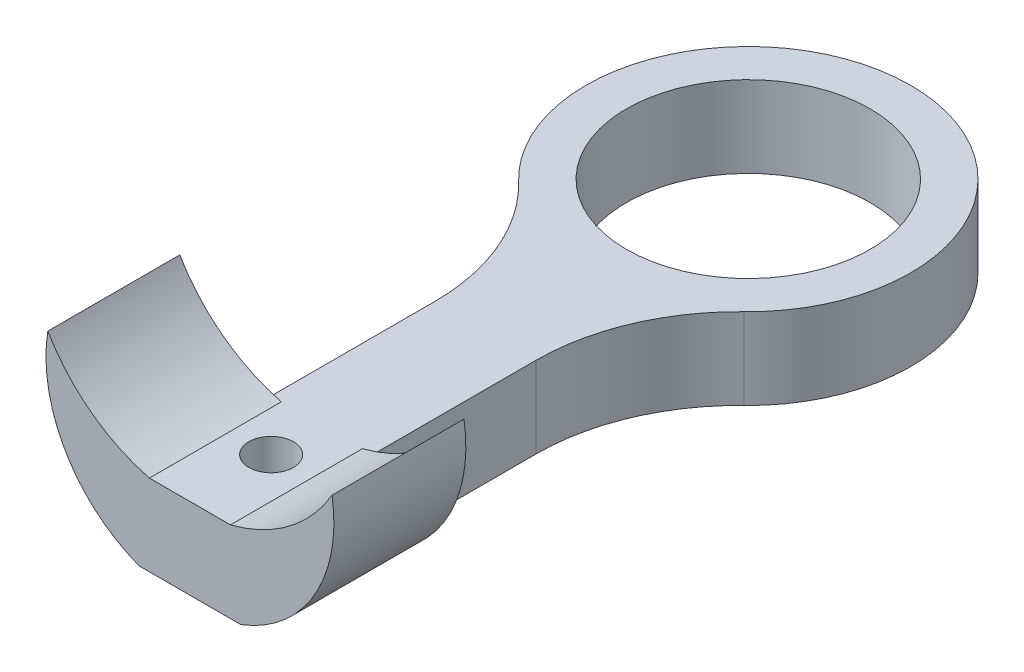
ISO-10303-21;
HEADER;
FILE_DESCRIPTION(('STEP AP214'),'2;1');
FILE_NAME('part.step','',(''),(''),'','','');
FILE_SCHEMA(('AUTOMOTIVE_DESIGN { 1 0 10303 214 1 1 1 1 }'));
ENDSEC;
DATA;
#1=APPLICATION_CONTEXT('core data for automotive mechanical design processes');
#2=APPLICATION_PROTOCOL_DEFINITION('international standard','automotive_design',2000,#1);
#3=PRODUCT_CONTEXT('',#1,'mechanical');
#4=PRODUCT('Part','Part','',(#3));
#5=PRODUCT_RELATED_PRODUCT_CATEGORY('part','',(#4));
#6=PRODUCT_DEFINITION_FORMATION('','',#4);
#7=PRODUCT_DEFINITION_CONTEXT('part definition',#1,'design');
#8=PRODUCT_DEFINITION('design','',#6,#7);
#9=PRODUCT_DEFINITION_SHAPE('','',#8);
#10=(LENGTH_UNIT() NAMED_UNIT(*) SI_UNIT(.MILLI.,.METRE.));
#11=(NAMED_UNIT(*) PLANE_ANGLE_UNIT() SI_UNIT($,.RADIAN.));
#12=(NAMED_UNIT(*) SI_UNIT($,.STERADIAN.) SOLID_ANGLE_UNIT());
#13=UNCERTAINTY_MEASURE_WITH_UNIT(LENGTH_MEASURE(1.E-05),#10,'distance_accuracy_value','');
#14=(GEOMETRIC_REPRESENTATION_CONTEXT(3) GLOBAL_UNCERTAINTY_ASSIGNED_CONTEXT((#13)) GLOBAL_UNIT_ASSIGNED_CONTEXT((#10,
#11,#12)) REPRESENTATION_CONTEXT('',''));
#15=CARTESIAN_POINT('',(0.,0.,0.));
#16=DIRECTION('',(0.,0.,1.));
#17=DIRECTION('',(1.,0.,0.));
#18=AXIS2_PLACEMENT_3D('',#15,#16,#17);
#19=CARTESIAN_POINT('',(12.5,4.,12.9518338469886));
#20=DIRECTION('',(0.,1.,0.));
#21=DIRECTION('',(0.,0.,1.));
#22=AXIS2_PLACEMENT_3D('',#19,#20,#21);
#23=PLANE('',#22);
#24=CARTESIAN_POINT('',(0.,4.,0.));
#25=DIRECTION('',(0.,1.,0.));
#26=DIRECTION('',(0.,0.,1.));
#27=AXIS2_PLACEMENT_3D('',#24,#25,#26);
#28=CIRCLE('',#27,6.);
#29=CARTESIAN_POINT('',(0.,4.,6.));
#30=VERTEX_POINT('',#29);
#31=EDGE_CURVE('E169',#30,#30,#28,.T.);
#32=ORIENTED_EDGE('',*,*,#31,.F.);
#33=EDGE_LOOP('',(#32));
#34=FACE_BOUND('',#33,.T.);
#35=CARTESIAN_POINT('',(0.,4.,23.5));
#36=DIRECTION('',(0.,1.,0.));
#37=DIRECTION('',(0.,0.,1.));
#38=AXIS2_PLACEMENT_3D('',#35,#36,#37);
#39=CIRCLE('',#38,1.1);
#40=CARTESIAN_POINT('',(0.,4.,24.6));
#41=VERTEX_POINT('',#40);
#42=EDGE_CURVE('E163',#41,#41,#39,.T.);
#43=ORIENTED_EDGE('',*,*,#42,.F.);
#44=EDGE_LOOP('',(#43));
#45=FACE_BOUND('',#44,.T.);
#46=DIRECTION('',(1.,0.,0.));
#47=VECTOR('',#46,1.);
#48=CARTESIAN_POINT('',(-2.5,4.,27.5));
#49=LINE('',#48,#47);
#50=CARTESIAN_POINT('',(-1.99783536705259,4.,27.5));
#51=VERTEX_POINT('',#50);
#52=CARTESIAN_POINT('',(1.9978353670526,4.,27.5));
#53=VERTEX_POINT('',#52);
#54=EDGE_CURVE('E135',#51,#53,#49,.T.);
#55=ORIENTED_EDGE('',*,*,#54,.T.);
#56=DIRECTION('',(0.,0.,1.));
#57=VECTOR('',#56,1.);
#58=CARTESIAN_POINT('',(1.9978353670526,4.,11.7121984810812));
#59=LINE('',#58,#57);
#60=CARTESIAN_POINT('',(1.9978353670526,4.,21.0000000000125));
#61=VERTEX_POINT('',#60);
#62=EDGE_CURVE('E128',#61,#53,#59,.T.);
#63=ORIENTED_EDGE('',*,*,#62,.F.);
#64=DIRECTION('',(-1.,0.,0.));
#65=VECTOR('',#64,1.);
#66=CARTESIAN_POINT('',(12.5,4.,21.0000000000125));
#67=LINE('',#66,#65);
#68=CARTESIAN_POINT('',(2.5,4.,21.0000000000125));
#69=VERTEX_POINT('',#68);
#70=EDGE_CURVE('E117',#69,#61,#67,.T.);
#71=ORIENTED_EDGE('',*,*,#70,.F.);
#72=DIRECTION('',(0.,0.,-1.));
#73=VECTOR('',#72,1.);
#74=CARTESIAN_POINT('',(2.5,4.,12.9518338469886));
#75=LINE('',#74,#73);
#76=CARTESIAN_POINT('',(2.5,4.,12.9518338469886));
#77=VERTEX_POINT('',#76);
#78=EDGE_CURVE('E179',#69,#77,#75,.T.);
#79=ORIENTED_EDGE('',*,*,#78,.T.);
#80=CARTESIAN_POINT('',(12.5,4.,12.9518338469886));
#81=DIRECTION('',(0.,-1.,0.));
#82=DIRECTION('',(0.,0.,1.));
#83=AXIS2_PLACEMENT_3D('',#80,#81,#82);
#84=CIRCLE('',#83,10.);
#85=CARTESIAN_POINT('',(5.55555555555555,4.,5.75637059866161));
#86=VERTEX_POINT('',#85);
#87=EDGE_CURVE('E181',#77,#86,#84,.T.);
#88=ORIENTED_EDGE('',*,*,#87,.T.);
#89=CARTESIAN_POINT('',(0.,4.,0.));
#90=DIRECTION('',(0.,1.,0.));
#91=DIRECTION('',(0.,0.,1.));
#92=AXIS2_PLACEMENT_3D('',#89,#90,#91);
#93=CIRCLE('',#92,8.);
#94=CARTESIAN_POINT('',(-5.55555555555555,4.,5.75637059866161));
#95=VERTEX_POINT('',#94);
#96=EDGE_CURVE('E183',#86,#95,#93,.T.);
#97=ORIENTED_EDGE('',*,*,#96,.T.);
#98=CARTESIAN_POINT('',(-12.5,4.,12.9518338469886));
#99=DIRECTION('',(0.,-1.,0.));
#100=DIRECTION('',(0.,0.,-1.));
#101=AXIS2_PLACEMENT_3D('',#98,#99,#100);
#102=CIRCLE('',#101,10.);
#103=CARTESIAN_POINT('',(-2.5,4.,12.9518338469886));
#104=VERTEX_POINT('',#103);
#105=EDGE_CURVE('E185',#95,#104,#102,.T.);
#106=ORIENTED_EDGE('',*,*,#105,.T.);
#107=DIRECTION('',(0.,0.,1.));
#108=VECTOR('',#107,1.);
#109=CARTESIAN_POINT('',(-2.5,4.,12.9518338469886));
#110=LINE('',#109,#108);
#111=CARTESIAN_POINT('',(-2.5,4.,21.0000000000125));
#112=VERTEX_POINT('',#111);
#113=EDGE_CURVE('E175',#104,#112,#110,.T.);
#114=ORIENTED_EDGE('',*,*,#113,.T.);
#115=DIRECTION('',(-1.,0.,0.));
#116=VECTOR('',#115,1.);
#117=CARTESIAN_POINT('',(12.5,4.,21.0000000000125));
#118=LINE('',#117,#116);
#119=CARTESIAN_POINT('',(-1.99783536705259,4.,21.0000000000125));
#120=VERTEX_POINT('',#119);
#121=EDGE_CURVE('E57',#120,#112,#118,.T.);
#122=ORIENTED_EDGE('',*,*,#121,.F.);
#123=DIRECTION('',(0.,0.,1.));
#124=VECTOR('',#123,1.);
#125=CARTESIAN_POINT('',(-1.9978353670526,4.,11.7121984810812));
#126=LINE('',#125,#124);
#127=EDGE_CURVE('E146',#120,#51,#126,.T.);
#128=ORIENTED_EDGE('',*,*,#127,.T.);
#129=EDGE_LOOP('',(#55,#63,#71,#79,#88,#97,#106,#114,#122,#128));
#130=FACE_BOUND('',#129,.T.);
#131=ADVANCED_FACE('F34',(#34,#45,#130),#23,.T.);
#132=CARTESIAN_POINT('',(12.5,0.,12.9518338469886));
#133=DIRECTION('',(0.,1.,0.));
#134=DIRECTION('',(0.,0.,1.));
#135=AXIS2_PLACEMENT_3D('',#132,#133,#134);
#136=PLANE('',#135);
#137=DIRECTION('',(0.,0.,1.));
#138=VECTOR('',#137,1.);
#139=CARTESIAN_POINT('',(-2.5,0.,12.9518338469886));
#140=LINE('',#139,#138);
#141=CARTESIAN_POINT('',(-2.5,0.,12.9518338469886));
#142=VERTEX_POINT('',#141);
#143=CARTESIAN_POINT('',(-2.5,0.,21.0000000000125));
#144=VERTEX_POINT('',#143);
#145=EDGE_CURVE('E172',#142,#144,#140,.T.);
#146=ORIENTED_EDGE('',*,*,#145,.F.);
#147=CARTESIAN_POINT('',(-12.5,0.,12.9518338469886));
#148=DIRECTION('',(0.,-1.,0.));
#149=DIRECTION('',(0.,0.,-1.));
#150=AXIS2_PLACEMENT_3D('',#147,#148,#149);
#151=CIRCLE('',#150,10.);
#152=CARTESIAN_POINT('',(-5.55555555555555,0.,5.75637059866161));
#153=VERTEX_POINT('',#152);
#154=EDGE_CURVE('E177',#153,#142,#151,.T.);
#155=ORIENTED_EDGE('',*,*,#154,.F.);
#156=CARTESIAN_POINT('',(0.,0.,0.));
#157=DIRECTION('',(0.,1.,0.));
#158=DIRECTION('',(0.,0.,1.));
#159=AXIS2_PLACEMENT_3D('',#156,#157,#158);
#160=CIRCLE('',#159,8.);
#161=CARTESIAN_POINT('',(5.55555555555555,0.,5.75637059866161));
#162=VERTEX_POINT('',#161);
#163=EDGE_CURVE('E198',#162,#153,#160,.T.);
#164=ORIENTED_EDGE('',*,*,#163,.F.);
#165=CARTESIAN_POINT('',(12.5,0.,12.9518338469886));
#166=DIRECTION('',(0.,-1.,0.));
#167=DIRECTION('',(0.,0.,1.));
#168=AXIS2_PLACEMENT_3D('',#165,#166,#167);
#169=CIRCLE('',#168,10.);
#170=CARTESIAN_POINT('',(2.5,0.,12.9518338469886));
#171=VERTEX_POINT('',#170);
#172=EDGE_CURVE('E196',#171,#162,#169,.T.);
#173=ORIENTED_EDGE('',*,*,#172,.F.);
#174=DIRECTION('',(0.,0.,-1.));
#175=VECTOR('',#174,1.);
#176=CARTESIAN_POINT('',(2.5,0.,12.9518338469886));
#177=LINE('',#176,#175);
#178=CARTESIAN_POINT('',(2.5,0.,21.0000000000125));
#179=VERTEX_POINT('',#178);
#180=EDGE_CURVE('E193',#179,#171,#177,.T.);
#181=ORIENTED_EDGE('',*,*,#180,.F.);
#182=CARTESIAN_POINT('',(2.5,0.,27.5));
#183=VERTEX_POINT('',#182);
#184=EDGE_CURVE('E194',#183,#179,#177,.T.);
#185=ORIENTED_EDGE('',*,*,#184,.F.);
#186=DIRECTION('',(1.,0.,0.));
#187=VECTOR('',#186,1.);
#188=CARTESIAN_POINT('',(-2.5,0.,27.5));
#189=LINE('',#188,#187);
#190=CARTESIAN_POINT('',(-2.5,0.,27.5));
#191=VERTEX_POINT('',#190);
#192=EDGE_CURVE('E190',#191,#183,#189,.T.);
#193=ORIENTED_EDGE('',*,*,#192,.F.);
#194=DIRECTION('',(0.,0.,1.));
#195=VECTOR('',#194,1.);
#196=CARTESIAN_POINT('',(-2.5,0.,11.7121984810812));
#197=LINE('',#196,#195);
#198=EDGE_CURVE('E152',#144,#191,#197,.T.);
#199=ORIENTED_EDGE('',*,*,#198,.F.);
#200=EDGE_LOOP('',(#146,#155,#164,#173,#181,#185,#193,#199));
#201=FACE_BOUND('',#200,.T.);
#202=CARTESIAN_POINT('',(0.,0.,0.));
#203=DIRECTION('',(0.,1.,0.));
#204=DIRECTION('',(0.,0.,1.));
#205=AXIS2_PLACEMENT_3D('',#202,#203,#204);
#206=CIRCLE('',#205,6.);
#207=CARTESIAN_POINT('',(0.,0.,6.));
#208=VERTEX_POINT('',#207);
#209=EDGE_CURVE('E166',#208,#208,#206,.T.);
#210=ORIENTED_EDGE('',*,*,#209,.T.);
#211=EDGE_LOOP('',(#210));
#212=FACE_BOUND('',#211,.T.);
#213=CARTESIAN_POINT('',(0.,0.,23.5));
#214=DIRECTION('',(0.,1.,0.));
#215=DIRECTION('',(0.,0.,1.));
#216=AXIS2_PLACEMENT_3D('',#213,#214,#215);
#217=CIRCLE('',#216,1.1);
#218=CARTESIAN_POINT('',(0.,0.,24.6));
#219=VERTEX_POINT('',#218);
#220=EDGE_CURVE('E162',#219,#219,#217,.T.);
#221=ORIENTED_EDGE('',*,*,#220,.T.);
#222=EDGE_LOOP('',(#221));
#223=FACE_BOUND('',#222,.T.);
#224=ADVANCED_FACE('F236',(#201,#212,#223),#136,.F.);
#225=CARTESIAN_POINT('',(-2.5,4.,12.9518338469886));
#226=DIRECTION('',(1.,0.,0.));
#227=DIRECTION('',(0.,0.,-1.));
#228=AXIS2_PLACEMENT_3D('',#225,#226,#227);
#229=PLANE('',#228);
#230=ORIENTED_EDGE('',*,*,#145,.T.);
#231=DIRECTION('',(0.,1.,0.));
#232=VECTOR('',#231,1.);
#233=CARTESIAN_POINT('',(-2.5,4.,21.0000000000125));
#234=LINE('',#233,#232);
#235=EDGE_CURVE('E42',#144,#112,#234,.T.);
#236=ORIENTED_EDGE('',*,*,#235,.T.);
#237=ORIENTED_EDGE('',*,*,#113,.F.);
#238=DIRECTION('',(0.,-1.,0.));
#239=VECTOR('',#238,1.);
#240=CARTESIAN_POINT('',(-2.5,4.,12.9518338469886));
#241=LINE('',#240,#239);
#242=EDGE_CURVE('E187',#104,#142,#241,.T.);
#243=ORIENTED_EDGE('',*,*,#242,.T.);
#244=EDGE_LOOP('',(#230,#236,#237,#243));
#245=FACE_BOUND('',#244,.T.);
#246=ADVANCED_FACE('F36',(#245),#229,.F.);
#247=CARTESIAN_POINT('',(-2.5,4.,27.5));
#248=DIRECTION('',(0.,0.,-1.));
#249=DIRECTION('',(-1.,0.,0.));
#250=AXIS2_PLACEMENT_3D('',#247,#248,#249);
#251=PLANE('',#250);
#252=CARTESIAN_POINT('',(0.,11.8576923076923,27.5));
#253=DIRECTION('',(0.,0.,1.));
#254=DIRECTION('',(-1.,0.,0.));
#255=AXIS2_PLACEMENT_3D('',#252,#253,#254);
#256=CIRCLE('',#255,8.10769230769231);
#257=CARTESIAN_POINT('',(7.,7.7668886511704,27.5));
#258=VERTEX_POINT('',#257);
#259=EDGE_CURVE('E131',#53,#258,#256,.T.);
#260=ORIENTED_EDGE('',*,*,#259,.F.);
#261=ORIENTED_EDGE('',*,*,#54,.F.);
#262=CARTESIAN_POINT('',(0.,11.8576923076923,27.5));
#263=DIRECTION('',(0.,0.,-1.));
#264=DIRECTION('',(1.,0.,0.));
#265=AXIS2_PLACEMENT_3D('',#262,#263,#264);
#266=CIRCLE('',#265,8.10769230769231);
#267=CARTESIAN_POINT('',(-7.,7.7668886511704,27.5));
#268=VERTEX_POINT('',#267);
#269=EDGE_CURVE('E143',#51,#268,#266,.T.);
#270=ORIENTED_EDGE('',*,*,#269,.T.);
#271=CARTESIAN_POINT('',(0.,6.63551158958273,27.5));
#272=DIRECTION('',(0.,0.,1.));
#273=DIRECTION('',(1.,0.,0.));
#274=AXIS2_PLACEMENT_3D('',#271,#272,#273);
#275=CIRCLE('',#274,7.09084015159606);
#276=EDGE_CURVE('E123',#268,#191,#275,.T.);
#277=ORIENTED_EDGE('',*,*,#276,.T.);
#278=ORIENTED_EDGE('',*,*,#192,.T.);
#279=CARTESIAN_POINT('',(0.,6.63551158958273,27.5));
#280=DIRECTION('',(0.,0.,-1.));
#281=DIRECTION('',(-1.,0.,0.));
#282=AXIS2_PLACEMENT_3D('',#279,#280,#281);
#283=CIRCLE('',#282,7.09084015159606);
#284=EDGE_CURVE('E136',#258,#183,#283,.T.);
#285=ORIENTED_EDGE('',*,*,#284,.F.);
#286=EDGE_LOOP('',(#260,#261,#270,#277,#278,#285));
#287=FACE_BOUND('',#286,.T.);
#288=ADVANCED_FACE('F225',(#287),#251,.F.);
#289=CARTESIAN_POINT('',(2.5,4.,12.9518338469886));
#290=DIRECTION('',(-1.,0.,0.));
#291=DIRECTION('',(0.,0.,1.));
#292=AXIS2_PLACEMENT_3D('',#289,#290,#291);
#293=PLANE('',#292);
#294=ORIENTED_EDGE('',*,*,#78,.F.);
#295=DIRECTION('',(0.,-1.,0.));
#296=VECTOR('',#295,1.);
#297=CARTESIAN_POINT('',(2.5,4.,21.0000000000125));
#298=LINE('',#297,#296);
#299=EDGE_CURVE('E11',#69,#179,#298,.T.);
#300=ORIENTED_EDGE('',*,*,#299,.T.);
#301=ORIENTED_EDGE('',*,*,#180,.T.);
#302=DIRECTION('',(0.,-1.,0.));
#303=VECTOR('',#302,1.);
#304=CARTESIAN_POINT('',(2.5,4.,12.9518338469886));
#305=LINE('',#304,#303);
#306=EDGE_CURVE('E209',#77,#171,#305,.T.);
#307=ORIENTED_EDGE('',*,*,#306,.F.);
#308=EDGE_LOOP('',(#294,#300,#301,#307));
#309=FACE_BOUND('',#308,.T.);
#310=ADVANCED_FACE('F233',(#309),#293,.F.);
#311=CARTESIAN_POINT('',(12.5,4.,12.9518338469886));
#312=DIRECTION('',(0.,-1.,0.));
#313=DIRECTION('',(0.,0.,-1.));
#314=AXIS2_PLACEMENT_3D('',#311,#312,#313);
#315=CYLINDRICAL_SURFACE('',#314,10.);
#316=ORIENTED_EDGE('',*,*,#172,.T.);
#317=DIRECTION('',(0.,-1.,0.));
#318=VECTOR('',#317,1.);
#319=CARTESIAN_POINT('',(5.55555555555555,4.,5.75637059866161));
#320=LINE('',#319,#318);
#321=EDGE_CURVE('E206',#86,#162,#320,.T.);
#322=ORIENTED_EDGE('',*,*,#321,.F.);
#323=ORIENTED_EDGE('',*,*,#87,.F.);
#324=ORIENTED_EDGE('',*,*,#306,.T.);
#325=EDGE_LOOP('',(#316,#322,#323,#324));
#326=FACE_BOUND('',#325,.T.);
#327=ADVANCED_FACE('F242',(#326),#315,.F.);
#328=CARTESIAN_POINT('',(0.,4.,0.));
#329=DIRECTION('',(0.,-1.,0.));
#330=DIRECTION('',(0.,0.,-1.));
#331=AXIS2_PLACEMENT_3D('',#328,#329,#330);
#332=CYLINDRICAL_SURFACE('',#331,8.);
#333=ORIENTED_EDGE('',*,*,#163,.T.);
#334=DIRECTION('',(0.,-1.,0.));
#335=VECTOR('',#334,1.);
#336=CARTESIAN_POINT('',(-5.55555555555555,4.,5.75637059866161));
#337=LINE('',#336,#335);
#338=EDGE_CURVE('E203',#95,#153,#337,.T.);
#339=ORIENTED_EDGE('',*,*,#338,.F.);
#340=ORIENTED_EDGE('',*,*,#96,.F.);
#341=ORIENTED_EDGE('',*,*,#321,.T.);
#342=EDGE_LOOP('',(#333,#339,#340,#341));
#343=FACE_BOUND('',#342,.T.);
#344=ADVANCED_FACE('F246',(#343),#332,.T.);
#345=CARTESIAN_POINT('',(-12.5,4.,12.9518338469886));
#346=DIRECTION('',(0.,-1.,0.));
#347=DIRECTION('',(0.,0.,-1.));
#348=AXIS2_PLACEMENT_3D('',#345,#346,#347);
#349=CYLINDRICAL_SURFACE('',#348,10.);
#350=ORIENTED_EDGE('',*,*,#154,.T.);
#351=ORIENTED_EDGE('',*,*,#242,.F.);
#352=ORIENTED_EDGE('',*,*,#105,.F.);
#353=ORIENTED_EDGE('',*,*,#338,.T.);
#354=EDGE_LOOP('',(#350,#351,#352,#353));
#355=FACE_BOUND('',#354,.T.);
#356=ADVANCED_FACE('F249',(#355),#349,.F.);
#357=CARTESIAN_POINT('',(0.,4.,0.));
#358=DIRECTION('',(0.,-1.,0.));
#359=DIRECTION('',(0.,0.,-1.));
#360=AXIS2_PLACEMENT_3D('',#357,#358,#359);
#361=CYLINDRICAL_SURFACE('',#360,6.);
#362=ORIENTED_EDGE('',*,*,#31,.T.);
#363=EDGE_LOOP('',(#362));
#364=FACE_BOUND('',#363,.T.);
#365=ORIENTED_EDGE('',*,*,#209,.F.);
#366=EDGE_LOOP('',(#365));
#367=FACE_BOUND('',#366,.T.);
#368=ADVANCED_FACE('F272',(#364,#367),#361,.F.);
#369=CARTESIAN_POINT('',(0.,4.,23.5));
#370=DIRECTION('',(0.,-1.,0.));
#371=DIRECTION('',(0.,0.,-1.));
#372=AXIS2_PLACEMENT_3D('',#369,#370,#371);
#373=CYLINDRICAL_SURFACE('',#372,1.1);
#374=ORIENTED_EDGE('',*,*,#42,.T.);
#375=EDGE_LOOP('',(#374));
#376=FACE_BOUND('',#375,.T.);
#377=ORIENTED_EDGE('',*,*,#220,.F.);
#378=EDGE_LOOP('',(#377));
#379=FACE_BOUND('',#378,.T.);
#380=ADVANCED_FACE('F349',(#376,#379),#373,.F.);
#381=CARTESIAN_POINT('',(0.,11.75,21.0000000000125));
#382=DIRECTION('',(0.,0.,-1.));
#383=DIRECTION('',(-1.,0.,0.));
#384=AXIS2_PLACEMENT_3D('',#381,#382,#383);
#385=PLANE('',#384);
#386=CARTESIAN_POINT('',(0.,11.8576923076923,21.0000000000125));
#387=DIRECTION('',(0.,0.,-1.));
#388=DIRECTION('',(-1.,0.,0.));
#389=AXIS2_PLACEMENT_3D('',#386,#387,#388);
#390=CIRCLE('',#389,8.10769230769231);
#391=CARTESIAN_POINT('',(-7.,7.7668886511704,21.0000000000125));
#392=VERTEX_POINT('',#391);
#393=EDGE_CURVE('E154',#120,#392,#390,.T.);
#394=ORIENTED_EDGE('',*,*,#393,.F.);
#395=ORIENTED_EDGE('',*,*,#121,.T.);
#396=ORIENTED_EDGE('',*,*,#235,.F.);
#397=CARTESIAN_POINT('',(0.,6.63551158958273,21.0000000000125));
#398=DIRECTION('',(0.,0.,-1.));
#399=DIRECTION('',(-1.,0.,0.));
#400=AXIS2_PLACEMENT_3D('',#397,#398,#399);
#401=CIRCLE('',#400,7.09084015159606);
#402=EDGE_CURVE('E149',#392,#144,#401,.F.);
#403=ORIENTED_EDGE('',*,*,#402,.F.);
#404=EDGE_LOOP('',(#394,#395,#396,#403));
#405=FACE_BOUND('',#404,.T.);
#406=ADVANCED_FACE('F218',(#405),#385,.T.);
#407=CARTESIAN_POINT('',(0.,11.8576923076923,11.7121984810812));
#408=DIRECTION('',(0.,0.,1.));
#409=DIRECTION('',(1.,0.,0.));
#410=AXIS2_PLACEMENT_3D('',#407,#408,#409);
#411=CYLINDRICAL_SURFACE('',#410,8.10769230769231);
#412=ORIENTED_EDGE('',*,*,#127,.F.);
#413=ORIENTED_EDGE('',*,*,#393,.T.);
#414=DIRECTION('',(0.,0.,1.));
#415=VECTOR('',#414,1.);
#416=CARTESIAN_POINT('',(-7.,7.7668886511704,11.7121984810812));
#417=LINE('',#416,#415);
#418=EDGE_CURVE('E153',#392,#268,#417,.T.);
#419=ORIENTED_EDGE('',*,*,#418,.T.);
#420=ORIENTED_EDGE('',*,*,#269,.F.);
#421=EDGE_LOOP('',(#412,#413,#419,#420));
#422=FACE_BOUND('',#421,.T.);
#423=ADVANCED_FACE('F223',(#422),#411,.F.);
#424=CARTESIAN_POINT('',(0.,6.63551158958273,11.7121984810812));
#425=DIRECTION('',(0.,0.,1.));
#426=DIRECTION('',(1.,0.,0.));
#427=AXIS2_PLACEMENT_3D('',#424,#425,#426);
#428=CYLINDRICAL_SURFACE('',#427,7.09084015159606);
#429=ORIENTED_EDGE('',*,*,#418,.F.);
#430=ORIENTED_EDGE('',*,*,#402,.T.);
#431=ORIENTED_EDGE('',*,*,#198,.T.);
#432=ORIENTED_EDGE('',*,*,#276,.F.);
#433=EDGE_LOOP('',(#429,#430,#431,#432));
#434=FACE_BOUND('',#433,.T.);
#435=ADVANCED_FACE('F252',(#434),#428,.T.);
#436=CARTESIAN_POINT('',(0.,6.63551158958273,11.7121984810812));
#437=DIRECTION('',(0.,0.,1.));
#438=DIRECTION('',(1.,0.,0.));
#439=AXIS2_PLACEMENT_3D('',#436,#437,#438);
#440=CYLINDRICAL_SURFACE('',#439,7.09084015159606);
#441=CARTESIAN_POINT('',(0.,6.63551158958273,21.0000000000125));
#442=DIRECTION('',(0.,0.,-1.));
#443=DIRECTION('',(-1.,0.,0.));
#444=AXIS2_PLACEMENT_3D('',#441,#442,#443);
#445=CIRCLE('',#444,7.09084015159606);
#446=CARTESIAN_POINT('',(7.,7.7668886511704,21.0000000000125));
#447=VERTEX_POINT('',#446);
#448=EDGE_CURVE('E49',#447,#179,#445,.T.);
#449=ORIENTED_EDGE('',*,*,#448,.F.);
#450=DIRECTION('',(0.,0.,1.));
#451=VECTOR('',#450,1.);
#452=CARTESIAN_POINT('',(7.,7.7668886511704,11.7121984810812));
#453=LINE('',#452,#451);
#454=EDGE_CURVE('E130',#447,#258,#453,.T.);
#455=ORIENTED_EDGE('',*,*,#454,.T.);
#456=ORIENTED_EDGE('',*,*,#284,.T.);
#457=ORIENTED_EDGE('',*,*,#184,.T.);
#458=EDGE_LOOP('',(#449,#455,#456,#457));
#459=FACE_BOUND('',#458,.T.);
#460=ADVANCED_FACE('F229',(#459),#440,.T.);
#461=CARTESIAN_POINT('',(0.,11.8576923076923,11.7121984810812));
#462=DIRECTION('',(0.,0.,1.));
#463=DIRECTION('',(1.,0.,0.));
#464=AXIS2_PLACEMENT_3D('',#461,#462,#463);
#465=CYLINDRICAL_SURFACE('',#464,8.10769230769231);
#466=CARTESIAN_POINT('',(0.,11.8576923076923,21.0000000000125));
#467=DIRECTION('',(0.,0.,-1.));
#468=DIRECTION('',(-1.,0.,0.));
#469=AXIS2_PLACEMENT_3D('',#466,#467,#468);
#470=CIRCLE('',#469,8.10769230769231);
#471=EDGE_CURVE('E120',#61,#447,#470,.F.);
#472=ORIENTED_EDGE('',*,*,#471,.F.);
#473=ORIENTED_EDGE('',*,*,#62,.T.);
#474=ORIENTED_EDGE('',*,*,#259,.T.);
#475=ORIENTED_EDGE('',*,*,#454,.F.);
#476=EDGE_LOOP('',(#472,#473,#474,#475));
#477=FACE_BOUND('',#476,.T.);
#478=ADVANCED_FACE('F126',(#477),#465,.F.);
#479=CARTESIAN_POINT('',(0.,11.75,21.0000000000125));
#480=DIRECTION('',(0.,0.,-1.));
#481=DIRECTION('',(-1.,0.,0.));
#482=AXIS2_PLACEMENT_3D('',#479,#480,#481);
#483=PLANE('',#482);
#484=ORIENTED_EDGE('',*,*,#299,.F.);
#485=ORIENTED_EDGE('',*,*,#70,.T.);
#486=ORIENTED_EDGE('',*,*,#471,.T.);
#487=ORIENTED_EDGE('',*,*,#448,.T.);
#488=EDGE_LOOP('',(#484,#485,#486,#487));
#489=FACE_BOUND('',#488,.T.);
#490=ADVANCED_FACE('F119',(#489),#483,.T.);
#491=CLOSED_SHELL('',(#131,#224,#246,#288,#310,#327,#344,#356,#368,#380,#406,#423,#435,#460,
#478,#490));
#492=MANIFOLD_SOLID_BREP('B2',#491);
#493=ADVANCED_BREP_SHAPE_REPRESENTATION('',(#18,#492),#14);
#494=SHAPE_DEFINITION_REPRESENTATION(#9,#493);
ENDSEC;
END-ISO-10303-21;
